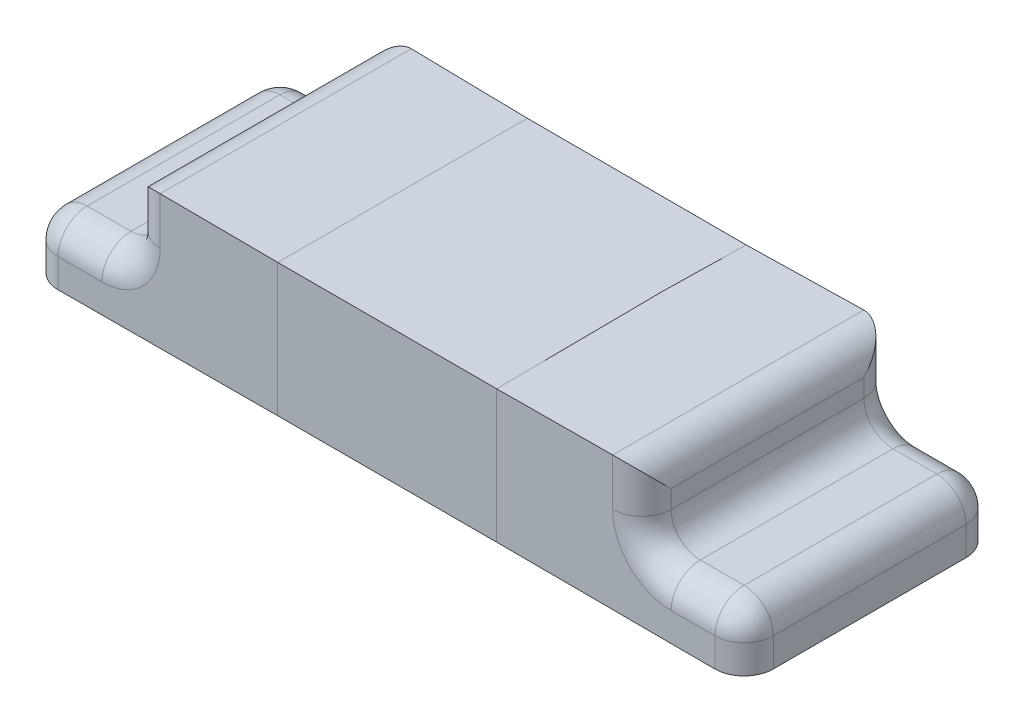
ISO-10303-21;
HEADER;
FILE_DESCRIPTION(('STEP AP214'),'2;1');
FILE_NAME('part.step','',(''),(''),'','','');
FILE_SCHEMA(('AUTOMOTIVE_DESIGN { 1 0 10303 214 1 1 1 1 }'));
ENDSEC;
DATA;
#1=APPLICATION_CONTEXT('core data for automotive mechanical design processes');
#2=APPLICATION_PROTOCOL_DEFINITION('international standard','automotive_design',2000,#1);
#3=PRODUCT_CONTEXT('',#1,'mechanical');
#4=PRODUCT('Part','Part','',(#3));
#5=PRODUCT_RELATED_PRODUCT_CATEGORY('part','',(#4));
#6=PRODUCT_DEFINITION_FORMATION('','',#4);
#7=PRODUCT_DEFINITION_CONTEXT('part definition',#1,'design');
#8=PRODUCT_DEFINITION('design','',#6,#7);
#9=PRODUCT_DEFINITION_SHAPE('','',#8);
#10=(LENGTH_UNIT() NAMED_UNIT(*) SI_UNIT(.MILLI.,.METRE.));
#11=(NAMED_UNIT(*) PLANE_ANGLE_UNIT() SI_UNIT($,.RADIAN.));
#12=(NAMED_UNIT(*) SI_UNIT($,.STERADIAN.) SOLID_ANGLE_UNIT());
#13=UNCERTAINTY_MEASURE_WITH_UNIT(LENGTH_MEASURE(1.E-05),#10,'distance_accuracy_value','');
#14=(GEOMETRIC_REPRESENTATION_CONTEXT(3) GLOBAL_UNCERTAINTY_ASSIGNED_CONTEXT((#13)) GLOBAL_UNIT_ASSIGNED_CONTEXT((#10,
#11,#12)) REPRESENTATION_CONTEXT('',''));
#15=CARTESIAN_POINT('',(0.,0.,0.));
#16=DIRECTION('',(0.,0.,1.));
#17=DIRECTION('',(1.,0.,0.));
#18=AXIS2_PLACEMENT_3D('',#15,#16,#17);
#19=CARTESIAN_POINT('',(0.875,0.,0.));
#20=DIRECTION('',(-1.,0.,0.));
#21=DIRECTION('',(0.,0.,1.));
#22=AXIS2_PLACEMENT_3D('',#19,#20,#21);
#23=PLANE('',#22);
#24=DIRECTION('',(0.,1.,0.));
#25=VECTOR('',#24,1.);
#26=CARTESIAN_POINT('',(0.875,0.,-0.33));
#27=LINE('',#26,#25);
#28=CARTESIAN_POINT('',(0.875,0.298442990090282,-0.33));
#29=VERTEX_POINT('',#28);
#30=CARTESIAN_POINT('',(0.875,0.36,-0.33));
#31=VERTEX_POINT('',#30);
#32=EDGE_CURVE('E508',#29,#31,#27,.T.);
#33=ORIENTED_EDGE('',*,*,#32,.T.);
#34=DIRECTION('',(0.,0.,1.));
#35=VECTOR('',#34,1.);
#36=CARTESIAN_POINT('',(0.875,0.36,0.));
#37=LINE('',#36,#35);
#38=CARTESIAN_POINT('',(0.875,0.36,0.33));
#39=VERTEX_POINT('',#38);
#40=EDGE_CURVE('E483',#31,#39,#37,.T.);
#41=ORIENTED_EDGE('',*,*,#40,.T.);
#42=DIRECTION('',(0.,-1.,0.));
#43=VECTOR('',#42,1.);
#44=CARTESIAN_POINT('',(0.875,0.,0.33));
#45=LINE('',#44,#43);
#46=CARTESIAN_POINT('',(0.875,0.298442990090282,0.33));
#47=VERTEX_POINT('',#46);
#48=EDGE_CURVE('E511',#39,#47,#45,.T.);
#49=ORIENTED_EDGE('',*,*,#48,.T.);
#50=DIRECTION('',(0.,0.,1.));
#51=VECTOR('',#50,1.);
#52=CARTESIAN_POINT('',(0.875,0.298442990090282,-0.43));
#53=LINE('',#52,#51);
#54=EDGE_CURVE('E273',#47,#29,#53,.F.);
#55=ORIENTED_EDGE('',*,*,#54,.T.);
#56=EDGE_LOOP('',(#33,#41,#49,#55));
#57=FACE_BOUND('',#56,.T.);
#58=ADVANCED_FACE('F40',(#57),#23,.F.);
#59=CARTESIAN_POINT('',(0.375,0.,-0.425));
#60=DIRECTION('',(0.,0.,1.));
#61=DIRECTION('',(1.,0.,0.));
#62=AXIS2_PLACEMENT_3D('',#59,#60,#61);
#63=PLANE('',#62);
#64=CARTESIAN_POINT('',(-0.375,0.,-0.425));
#65=DIRECTION('',(0.,1.,0.));
#66=VECTOR('',#65,1.);
#67=LINE('',#64,#66);
#68=CARTESIAN_POINT('',(-0.375,0.,-0.4275));
#69=VERTEX_POINT('',#68);
#70=CARTESIAN_POINT('',(-0.375,0.455,-0.4275));
#71=VERTEX_POINT('',#70);
#72=EDGE_CURVE('E233',#69,#71,#67,.T.);
#73=ORIENTED_EDGE('',*,*,#72,.T.);
#74=DIRECTION('',(-1.,0.,0.));
#75=VECTOR('',#74,1.);
#76=CARTESIAN_POINT('',(0.375,0.45,-0.425));
#77=LINE('',#76,#75);
#78=CARTESIAN_POINT('',(0.375,0.454472135955,-0.4272360679775));
#79=VERTEX_POINT('',#78);
#80=EDGE_CURVE('E270',#79,#71,#77,.T.);
#81=ORIENTED_EDGE('',*,*,#80,.F.);
#82=CARTESIAN_POINT('',(0.375,0.,-0.43));
#83=DIRECTION('',(0.,1.,0.));
#84=VECTOR('',#83,1.);
#85=LINE('',#82,#84);
#86=CARTESIAN_POINT('',(0.375,0.,-0.4275));
#87=VERTEX_POINT('',#86);
#88=EDGE_CURVE('E249',#87,#79,#85,.T.);
#89=ORIENTED_EDGE('',*,*,#88,.F.);
#90=DIRECTION('',(-1.,0.,0.));
#91=VECTOR('',#90,1.);
#92=CARTESIAN_POINT('',(0.375,0.,-0.425));
#93=LINE('',#92,#91);
#94=EDGE_CURVE('E222',#87,#69,#93,.T.);
#95=ORIENTED_EDGE('',*,*,#94,.T.);
#96=EDGE_LOOP('',(#73,#81,#89,#95));
#97=FACE_BOUND('',#96,.T.);
#98=ADVANCED_FACE('F247',(#97),#63,.F.);
#99=CARTESIAN_POINT('',(0.375,0.45,0.425));
#100=DIRECTION('',(0.,-1.,0.));
#101=DIRECTION('',(0.,0.,-1.));
#102=AXIS2_PLACEMENT_3D('',#99,#100,#101);
#103=PLANE('',#102);
#104=CARTESIAN_POINT('',(-0.375,0.45,-0.425));
#105=DIRECTION('',(0.,0.,1.));
#106=VECTOR('',#105,1.);
#107=LINE('',#104,#106);
#108=CARTESIAN_POINT('',(-0.375,0.455,0.4275));
#109=VERTEX_POINT('',#108);
#110=EDGE_CURVE('E243',#71,#109,#107,.T.);
#111=ORIENTED_EDGE('',*,*,#110,.T.);
#112=DIRECTION('',(-1.,0.,0.));
#113=VECTOR('',#112,1.);
#114=CARTESIAN_POINT('',(0.375,0.45,0.425));
#115=LINE('',#114,#113);
#116=CARTESIAN_POINT('',(0.375,0.455,0.4275));
#117=VERTEX_POINT('',#116);
#118=EDGE_CURVE('E255',#117,#109,#115,.T.);
#119=ORIENTED_EDGE('',*,*,#118,.F.);
#120=DIRECTION('',(0.,0.,1.));
#121=VECTOR('',#120,1.);
#122=CARTESIAN_POINT('',(0.375,0.45,0.425));
#123=LINE('',#122,#121);
#124=EDGE_CURVE('E258',#79,#117,#123,.T.);
#125=ORIENTED_EDGE('',*,*,#124,.F.);
#126=ORIENTED_EDGE('',*,*,#80,.T.);
#127=EDGE_LOOP('',(#111,#119,#125,#126));
#128=FACE_BOUND('',#127,.T.);
#129=ADVANCED_FACE('F297',(#128),#103,.F.);
#130=CARTESIAN_POINT('',(0.375,0.,0.425));
#131=DIRECTION('',(0.,0.,-1.));
#132=DIRECTION('',(-1.,0.,0.));
#133=AXIS2_PLACEMENT_3D('',#130,#131,#132);
#134=PLANE('',#133);
#135=CARTESIAN_POINT('',(-0.375,0.45,0.425));
#136=DIRECTION('',(0.,-1.,0.));
#137=VECTOR('',#136,1.);
#138=LINE('',#135,#137);
#139=CARTESIAN_POINT('',(-0.375,0.,0.4275));
#140=VERTEX_POINT('',#139);
#141=EDGE_CURVE('E338',#109,#140,#138,.T.);
#142=ORIENTED_EDGE('',*,*,#141,.T.);
#143=DIRECTION('',(-1.,0.,0.));
#144=VECTOR('',#143,1.);
#145=CARTESIAN_POINT('',(0.375,0.,0.425));
#146=LINE('',#145,#144);
#147=CARTESIAN_POINT('',(0.375,0.,0.4275));
#148=VERTEX_POINT('',#147);
#149=EDGE_CURVE('E251',#148,#140,#146,.T.);
#150=ORIENTED_EDGE('',*,*,#149,.F.);
#151=CARTESIAN_POINT('',(0.375,0.46,0.43));
#152=DIRECTION('',(0.,-1.,0.));
#153=VECTOR('',#152,1.);
#154=LINE('',#151,#153);
#155=EDGE_CURVE('E252',#117,#148,#154,.T.);
#156=ORIENTED_EDGE('',*,*,#155,.F.);
#157=ORIENTED_EDGE('',*,*,#118,.T.);
#158=EDGE_LOOP('',(#142,#150,#156,#157));
#159=FACE_BOUND('',#158,.T.);
#160=ADVANCED_FACE('F287',(#159),#134,.F.);
#161=CARTESIAN_POINT('',(0.375,0.,0.425));
#162=DIRECTION('',(0.,1.,0.));
#163=DIRECTION('',(0.,0.,1.));
#164=AXIS2_PLACEMENT_3D('',#161,#162,#163);
#165=PLANE('',#164);
#166=DIRECTION('',(0.,0.,-1.));
#167=VECTOR('',#166,1.);
#168=CARTESIAN_POINT('',(-1.225,0.,0.43));
#169=LINE('',#168,#167);
#170=CARTESIAN_POINT('',(-1.225,0.,0.33));
#171=VERTEX_POINT('',#170);
#172=CARTESIAN_POINT('',(-1.225,0.,-0.33));
#173=VERTEX_POINT('',#172);
#174=EDGE_CURVE('E327',#171,#173,#169,.T.);
#175=ORIENTED_EDGE('',*,*,#174,.T.);
#176=CARTESIAN_POINT('',(-1.125,0.,-0.33));
#177=DIRECTION('',(0.,1.,0.));
#178=DIRECTION('',(0.,0.,1.));
#179=AXIS2_PLACEMENT_3D('',#176,#177,#178);
#180=CIRCLE('',#179,0.1);
#181=CARTESIAN_POINT('',(-1.125,0.,-0.43));
#182=VERTEX_POINT('',#181);
#183=EDGE_CURVE('E225',#173,#182,#180,.F.);
#184=ORIENTED_EDGE('',*,*,#183,.T.);
#185=DIRECTION('',(1.,0.,0.));
#186=VECTOR('',#185,1.);
#187=CARTESIAN_POINT('',(-0.875,0.,-0.43));
#188=LINE('',#187,#186);
#189=EDGE_CURVE('E216',#182,#69,#188,.T.);
#190=ORIENTED_EDGE('',*,*,#189,.T.);
#191=ORIENTED_EDGE('',*,*,#94,.F.);
#192=DIRECTION('',(-1.,0.,0.));
#193=VECTOR('',#192,1.);
#194=CARTESIAN_POINT('',(0.875,0.,-0.43));
#195=LINE('',#194,#193);
#196=CARTESIAN_POINT('',(1.125,0.,-0.43));
#197=VERTEX_POINT('',#196);
#198=EDGE_CURVE('E465',#197,#87,#195,.T.);
#199=ORIENTED_EDGE('',*,*,#198,.F.);
#200=CARTESIAN_POINT('',(1.125,0.,-0.33));
#201=DIRECTION('',(0.,1.,0.));
#202=DIRECTION('',(0.,0.,1.));
#203=AXIS2_PLACEMENT_3D('',#200,#201,#202);
#204=CIRCLE('',#203,0.1);
#205=CARTESIAN_POINT('',(1.225,0.,-0.33));
#206=VERTEX_POINT('',#205);
#207=EDGE_CURVE('E663',#197,#206,#204,.F.);
#208=ORIENTED_EDGE('',*,*,#207,.T.);
#209=DIRECTION('',(0.,0.,-1.));
#210=VECTOR('',#209,1.);
#211=CARTESIAN_POINT('',(1.225,0.,0.43));
#212=LINE('',#211,#210);
#213=CARTESIAN_POINT('',(1.225,0.,0.33));
#214=VERTEX_POINT('',#213);
#215=EDGE_CURVE('E458',#214,#206,#212,.T.);
#216=ORIENTED_EDGE('',*,*,#215,.F.);
#217=CARTESIAN_POINT('',(1.125,0.,0.33));
#218=DIRECTION('',(0.,1.,0.));
#219=DIRECTION('',(0.,0.,1.));
#220=AXIS2_PLACEMENT_3D('',#217,#218,#219);
#221=CIRCLE('',#220,0.1);
#222=CARTESIAN_POINT('',(1.125,0.,0.43));
#223=VERTEX_POINT('',#222);
#224=EDGE_CURVE('E659',#214,#223,#221,.F.);
#225=ORIENTED_EDGE('',*,*,#224,.T.);
#226=DIRECTION('',(-1.,0.,0.));
#227=VECTOR('',#226,1.);
#228=CARTESIAN_POINT('',(0.875,0.,0.43));
#229=LINE('',#228,#227);
#230=EDGE_CURVE('E409',#223,#148,#229,.T.);
#231=ORIENTED_EDGE('',*,*,#230,.T.);
#232=ORIENTED_EDGE('',*,*,#149,.T.);
#233=DIRECTION('',(1.,0.,0.));
#234=VECTOR('',#233,1.);
#235=CARTESIAN_POINT('',(-0.875,0.,0.43));
#236=LINE('',#235,#234);
#237=CARTESIAN_POINT('',(-1.125,0.,0.43));
#238=VERTEX_POINT('',#237);
#239=EDGE_CURVE('E230',#238,#140,#236,.T.);
#240=ORIENTED_EDGE('',*,*,#239,.F.);
#241=CARTESIAN_POINT('',(-1.125,0.,0.33));
#242=DIRECTION('',(0.,1.,0.));
#243=DIRECTION('',(0.,0.,1.));
#244=AXIS2_PLACEMENT_3D('',#241,#242,#243);
#245=CIRCLE('',#244,0.1);
#246=EDGE_CURVE('E63',#238,#171,#245,.F.);
#247=ORIENTED_EDGE('',*,*,#246,.T.);
#248=EDGE_LOOP('',(#175,#184,#190,#191,#199,#208,#216,#225,#231,#232,#240,#247));
#249=FACE_BOUND('',#248,.T.);
#250=ADVANCED_FACE('F219',(#249),#165,.F.);
#251=CARTESIAN_POINT('',(0.875,0.,-0.43));
#252=DIRECTION('',(0.,0.,1.));
#253=DIRECTION('',(1.,0.,0.));
#254=AXIS2_PLACEMENT_3D('',#251,#252,#253);
#255=PLANE('',#254);
#256=DIRECTION('',(-1.,0.,0.));
#257=VECTOR('',#256,1.);
#258=CARTESIAN_POINT('',(0.875,0.098442990090282,-0.43));
#259=LINE('',#258,#257);
#260=CARTESIAN_POINT('',(0.975,0.098442990090282,-0.43));
#261=VERTEX_POINT('',#260);
#262=CARTESIAN_POINT('',(1.125,0.098442990090282,-0.43));
#263=VERTEX_POINT('',#262);
#264=EDGE_CURVE('E485',#261,#263,#259,.F.);
#265=ORIENTED_EDGE('',*,*,#264,.T.);
#266=DIRECTION('',(0.,1.,0.));
#267=VECTOR('',#266,1.);
#268=CARTESIAN_POINT('',(1.125,0.,-0.43));
#269=LINE('',#268,#267);
#270=EDGE_CURVE('E464',#263,#197,#269,.F.);
#271=ORIENTED_EDGE('',*,*,#270,.T.);
#272=ORIENTED_EDGE('',*,*,#198,.T.);
#273=ORIENTED_EDGE('',*,*,#88,.T.);
#274=DIRECTION('',(-1.,0.,0.));
#275=VECTOR('',#274,1.);
#276=CARTESIAN_POINT('',(0.875,0.46,-0.43));
#277=LINE('',#276,#275);
#278=CARTESIAN_POINT('',(0.775,0.46,-0.43));
#279=VERTEX_POINT('',#278);
#280=EDGE_CURVE('E244',#279,#79,#277,.T.);
#281=ORIENTED_EDGE('',*,*,#280,.F.);
#282=DIRECTION('',(0.,1.,0.));
#283=VECTOR('',#282,1.);
#284=CARTESIAN_POINT('',(0.775,0.,-0.43));
#285=LINE('',#284,#283);
#286=CARTESIAN_POINT('',(0.775,0.298442990090282,-0.43));
#287=VERTEX_POINT('',#286);
#288=EDGE_CURVE('E410',#279,#287,#285,.F.);
#289=ORIENTED_EDGE('',*,*,#288,.T.);
#290=CARTESIAN_POINT('',(0.975,0.298442990090282,-0.43));
#291=DIRECTION('',(0.,0.,1.));
#292=DIRECTION('',(1.,0.,0.));
#293=AXIS2_PLACEMENT_3D('',#290,#291,#292);
#294=CIRCLE('',#293,0.2);
#295=EDGE_CURVE('E487',#261,#287,#294,.F.);
#296=ORIENTED_EDGE('',*,*,#295,.F.);
#297=EDGE_LOOP('',(#265,#271,#272,#273,#281,#289,#296));
#298=FACE_BOUND('',#297,.T.);
#299=ADVANCED_FACE('F495',(#298),#255,.F.);
#300=CARTESIAN_POINT('',(0.875,0.46,0.43));
#301=DIRECTION('',(0.,-1.,0.));
#302=DIRECTION('',(0.,0.,-1.));
#303=AXIS2_PLACEMENT_3D('',#300,#301,#302);
#304=PLANE('',#303);
#305=DIRECTION('',(-1.,0.,0.));
#306=VECTOR('',#305,1.);
#307=CARTESIAN_POINT('',(0.875,0.46,0.43));
#308=LINE('',#307,#306);
#309=CARTESIAN_POINT('',(0.775,0.46,0.43));
#310=VERTEX_POINT('',#309);
#311=EDGE_CURVE('E406',#310,#117,#308,.T.);
#312=ORIENTED_EDGE('',*,*,#311,.F.);
#313=DIRECTION('',(0.,0.,1.));
#314=VECTOR('',#313,1.);
#315=CARTESIAN_POINT('',(0.775,0.46,0.43));
#316=LINE('',#315,#314);
#317=EDGE_CURVE('E419',#310,#279,#316,.F.);
#318=ORIENTED_EDGE('',*,*,#317,.T.);
#319=ORIENTED_EDGE('',*,*,#280,.T.);
#320=DIRECTION('',(0.,0.,1.));
#321=VECTOR('',#320,1.);
#322=CARTESIAN_POINT('',(0.375,0.46,0.43));
#323=LINE('',#322,#321);
#324=EDGE_CURVE('E468',#79,#117,#323,.T.);
#325=ORIENTED_EDGE('',*,*,#324,.T.);
#326=EDGE_LOOP('',(#312,#318,#319,#325));
#327=FACE_BOUND('',#326,.T.);
#328=ADVANCED_FACE('F389',(#327),#304,.F.);
#329=CARTESIAN_POINT('',(0.875,0.,0.43));
#330=DIRECTION('',(0.,0.,-1.));
#331=DIRECTION('',(-1.,0.,0.));
#332=AXIS2_PLACEMENT_3D('',#329,#330,#331);
#333=PLANE('',#332);
#334=ORIENTED_EDGE('',*,*,#230,.F.);
#335=DIRECTION('',(0.,-1.,0.));
#336=VECTOR('',#335,1.);
#337=CARTESIAN_POINT('',(1.125,0.,0.43));
#338=LINE('',#337,#336);
#339=CARTESIAN_POINT('',(1.125,0.098442990090282,0.43));
#340=VERTEX_POINT('',#339);
#341=EDGE_CURVE('E665',#223,#340,#338,.F.);
#342=ORIENTED_EDGE('',*,*,#341,.T.);
#343=DIRECTION('',(-1.,0.,0.));
#344=VECTOR('',#343,1.);
#345=CARTESIAN_POINT('',(0.875,0.098442990090282,0.43));
#346=LINE('',#345,#344);
#347=CARTESIAN_POINT('',(0.975,0.098442990090282,0.43));
#348=VERTEX_POINT('',#347);
#349=EDGE_CURVE('E415',#340,#348,#346,.T.);
#350=ORIENTED_EDGE('',*,*,#349,.T.);
#351=CARTESIAN_POINT('',(0.975,0.298442990090282,0.43));
#352=DIRECTION('',(0.,0.,-1.));
#353=DIRECTION('',(-1.,0.,0.));
#354=AXIS2_PLACEMENT_3D('',#351,#352,#353);
#355=CIRCLE('',#354,0.2);
#356=CARTESIAN_POINT('',(0.775,0.298442990090282,0.43));
#357=VERTEX_POINT('',#356);
#358=EDGE_CURVE('E412',#357,#348,#355,.F.);
#359=ORIENTED_EDGE('',*,*,#358,.F.);
#360=DIRECTION('',(0.,-1.,0.));
#361=VECTOR('',#360,1.);
#362=CARTESIAN_POINT('',(0.775,0.,0.43));
#363=LINE('',#362,#361);
#364=EDGE_CURVE('E417',#357,#310,#363,.F.);
#365=ORIENTED_EDGE('',*,*,#364,.T.);
#366=ORIENTED_EDGE('',*,*,#311,.T.);
#367=ORIENTED_EDGE('',*,*,#155,.T.);
#368=EDGE_LOOP('',(#334,#342,#350,#359,#365,#366,#367));
#369=FACE_BOUND('',#368,.T.);
#370=ADVANCED_FACE('F384',(#369),#333,.F.);
#371=CARTESIAN_POINT('',(0.375,0.,0.));
#372=DIRECTION('',(-1.,0.,0.));
#373=DIRECTION('',(0.,0.,1.));
#374=AXIS2_PLACEMENT_3D('',#371,#372,#373);
#375=PLANE('',#374);
#376=ORIENTED_EDGE('',*,*,#324,.F.);
#377=ORIENTED_EDGE('',*,*,#124,.T.);
#378=EDGE_LOOP('',(#376,#377));
#379=FACE_BOUND('',#378,.T.);
#380=ADVANCED_FACE('F377',(#379),#375,.T.);
#381=CARTESIAN_POINT('',(1.225,0.198442990090282,0.43));
#382=DIRECTION('',(0.,-1.,0.));
#383=DIRECTION('',(0.,0.,-1.));
#384=AXIS2_PLACEMENT_3D('',#381,#382,#383);
#385=PLANE('',#384);
#386=DIRECTION('',(-1.,0.,0.));
#387=VECTOR('',#386,1.);
#388=CARTESIAN_POINT('',(1.225,0.198442990090282,-0.33));
#389=LINE('',#388,#387);
#390=CARTESIAN_POINT('',(1.125,0.198442990090282,-0.33));
#391=VERTEX_POINT('',#390);
#392=CARTESIAN_POINT('',(0.975,0.198442990090282,-0.33));
#393=VERTEX_POINT('',#392);
#394=EDGE_CURVE('E427',#391,#393,#389,.T.);
#395=ORIENTED_EDGE('',*,*,#394,.T.);
#396=DIRECTION('',(0.,0.,1.));
#397=VECTOR('',#396,1.);
#398=CARTESIAN_POINT('',(0.975,0.198442990090282,0.43));
#399=LINE('',#398,#397);
#400=CARTESIAN_POINT('',(0.975,0.198442990090282,0.33));
#401=VERTEX_POINT('',#400);
#402=EDGE_CURVE('E430',#393,#401,#399,.T.);
#403=ORIENTED_EDGE('',*,*,#402,.T.);
#404=DIRECTION('',(-1.,0.,0.));
#405=VECTOR('',#404,1.);
#406=CARTESIAN_POINT('',(1.225,0.198442990090282,0.33));
#407=LINE('',#406,#405);
#408=CARTESIAN_POINT('',(1.125,0.198442990090282,0.33));
#409=VERTEX_POINT('',#408);
#410=EDGE_CURVE('E424',#401,#409,#407,.F.);
#411=ORIENTED_EDGE('',*,*,#410,.T.);
#412=DIRECTION('',(0.,0.,1.));
#413=VECTOR('',#412,1.);
#414=CARTESIAN_POINT('',(1.125,0.198442990090282,0.43));
#415=LINE('',#414,#413);
#416=EDGE_CURVE('E421',#409,#391,#415,.F.);
#417=ORIENTED_EDGE('',*,*,#416,.T.);
#418=EDGE_LOOP('',(#395,#403,#411,#417));
#419=FACE_BOUND('',#418,.T.);
#420=ADVANCED_FACE('F373',(#419),#385,.F.);
#421=CARTESIAN_POINT('',(1.225,0.,0.));
#422=DIRECTION('',(-1.,0.,0.));
#423=DIRECTION('',(0.,0.,1.));
#424=AXIS2_PLACEMENT_3D('',#421,#422,#423);
#425=PLANE('',#424);
#426=ORIENTED_EDGE('',*,*,#215,.T.);
#427=DIRECTION('',(0.,1.,0.));
#428=VECTOR('',#427,1.);
#429=CARTESIAN_POINT('',(1.225,0.,-0.33));
#430=LINE('',#429,#428);
#431=CARTESIAN_POINT('',(1.225,0.098442990090282,-0.33));
#432=VERTEX_POINT('',#431);
#433=EDGE_CURVE('E461',#206,#432,#430,.T.);
#434=ORIENTED_EDGE('',*,*,#433,.T.);
#435=DIRECTION('',(0.,0.,1.));
#436=VECTOR('',#435,1.);
#437=CARTESIAN_POINT('',(1.225,0.098442990090282,0.));
#438=LINE('',#437,#436);
#439=CARTESIAN_POINT('',(1.225,0.098442990090282,0.33));
#440=VERTEX_POINT('',#439);
#441=EDGE_CURVE('E432',#432,#440,#438,.T.);
#442=ORIENTED_EDGE('',*,*,#441,.T.);
#443=DIRECTION('',(0.,-1.,0.));
#444=VECTOR('',#443,1.);
#445=CARTESIAN_POINT('',(1.225,0.,0.33));
#446=LINE('',#445,#444);
#447=EDGE_CURVE('E435',#440,#214,#446,.T.);
#448=ORIENTED_EDGE('',*,*,#447,.T.);
#449=EDGE_LOOP('',(#426,#434,#442,#448));
#450=FACE_BOUND('',#449,.T.);
#451=ADVANCED_FACE('F362',(#450),#425,.F.);
#452=CARTESIAN_POINT('',(0.875,0.098442990090282,0.33));
#453=DIRECTION('',(-1.,0.,0.));
#454=DIRECTION('',(0.,0.,1.));
#455=AXIS2_PLACEMENT_3D('',#452,#453,#454);
#456=CYLINDRICAL_SURFACE('',#455,0.1);
#457=ORIENTED_EDGE('',*,*,#349,.F.);
#458=CARTESIAN_POINT('',(1.125,0.098442990090282,0.33));
#459=DIRECTION('',(-1.,0.,0.));
#460=DIRECTION('',(0.,0.,1.));
#461=AXIS2_PLACEMENT_3D('',#458,#459,#460);
#462=CIRCLE('',#461,0.1);
#463=EDGE_CURVE('E673',#340,#409,#462,.T.);
#464=ORIENTED_EDGE('',*,*,#463,.T.);
#465=ORIENTED_EDGE('',*,*,#410,.F.);
#466=CARTESIAN_POINT('',(0.975,0.098442990090282,0.33));
#467=DIRECTION('',(-1.,0.,0.));
#468=DIRECTION('',(0.,0.,1.));
#469=AXIS2_PLACEMENT_3D('',#466,#467,#468);
#470=CIRCLE('',#469,0.1);
#471=EDGE_CURVE('E455',#348,#401,#470,.T.);
#472=ORIENTED_EDGE('',*,*,#471,.F.);
#473=EDGE_LOOP('',(#457,#464,#465,#472));
#474=FACE_BOUND('',#473,.T.);
#475=ADVANCED_FACE('F372',(#474),#456,.T.);
#476=CARTESIAN_POINT('',(1.125,0.098442990090282,0.));
#477=DIRECTION('',(0.,0.,1.));
#478=DIRECTION('',(1.,0.,0.));
#479=AXIS2_PLACEMENT_3D('',#476,#477,#478);
#480=CYLINDRICAL_SURFACE('',#479,0.1);
#481=ORIENTED_EDGE('',*,*,#441,.F.);
#482=CARTESIAN_POINT('',(1.125,0.098442990090282,-0.33));
#483=DIRECTION('',(0.,0.,1.));
#484=DIRECTION('',(1.,0.,0.));
#485=AXIS2_PLACEMENT_3D('',#482,#483,#484);
#486=CIRCLE('',#485,0.1);
#487=EDGE_CURVE('E671',#432,#391,#486,.T.);
#488=ORIENTED_EDGE('',*,*,#487,.T.);
#489=ORIENTED_EDGE('',*,*,#416,.F.);
#490=CARTESIAN_POINT('',(1.125,0.098442990090282,0.33));
#491=DIRECTION('',(0.,0.,1.));
#492=DIRECTION('',(1.,0.,0.));
#493=AXIS2_PLACEMENT_3D('',#490,#491,#492);
#494=CIRCLE('',#493,0.1);
#495=EDGE_CURVE('E669',#409,#440,#494,.F.);
#496=ORIENTED_EDGE('',*,*,#495,.T.);
#497=EDGE_LOOP('',(#481,#488,#489,#496));
#498=FACE_BOUND('',#497,.T.);
#499=ADVANCED_FACE('F548',(#498),#480,.T.);
#500=CARTESIAN_POINT('',(0.975,0.298442990090282,0.33));
#501=DIRECTION('',(0.,0.,-1.));
#502=DIRECTION('',(-1.,0.,0.));
#503=AXIS2_PLACEMENT_3D('',#500,#501,#502);
#504=TOROIDAL_SURFACE('',#503,0.2,0.1);
#505=ORIENTED_EDGE('',*,*,#358,.T.);
#506=ORIENTED_EDGE('',*,*,#471,.T.);
#507=CARTESIAN_POINT('',(0.975,0.298442990090282,0.33));
#508=DIRECTION('',(0.,0.,-1.));
#509=DIRECTION('',(-1.,0.,0.));
#510=AXIS2_PLACEMENT_3D('',#507,#508,#509);
#511=CIRCLE('',#510,0.1);
#512=EDGE_CURVE('E452',#47,#401,#511,.F.);
#513=ORIENTED_EDGE('',*,*,#512,.F.);
#514=CARTESIAN_POINT('',(0.775,0.298442990090282,0.33));
#515=DIRECTION('',(0.,-1.,0.));
#516=DIRECTION('',(0.,0.,-1.));
#517=AXIS2_PLACEMENT_3D('',#514,#515,#516);
#518=CIRCLE('',#517,0.1);
#519=EDGE_CURVE('E449',#357,#47,#518,.F.);
#520=ORIENTED_EDGE('',*,*,#519,.F.);
#521=EDGE_LOOP('',(#505,#506,#513,#520));
#522=FACE_BOUND('',#521,.T.);
#523=ADVANCED_FACE('F523',(#522),#504,.T.);
#524=CARTESIAN_POINT('',(1.225,0.098442990090282,-0.33));
#525=DIRECTION('',(-1.,0.,0.));
#526=DIRECTION('',(0.,0.,1.));
#527=AXIS2_PLACEMENT_3D('',#524,#525,#526);
#528=CYLINDRICAL_SURFACE('',#527,0.1);
#529=ORIENTED_EDGE('',*,*,#394,.F.);
#530=CARTESIAN_POINT('',(1.125,0.098442990090282,-0.33));
#531=DIRECTION('',(-1.,0.,0.));
#532=DIRECTION('',(0.,0.,1.));
#533=AXIS2_PLACEMENT_3D('',#530,#531,#532);
#534=CIRCLE('',#533,0.1);
#535=EDGE_CURVE('E667',#391,#263,#534,.T.);
#536=ORIENTED_EDGE('',*,*,#535,.T.);
#537=ORIENTED_EDGE('',*,*,#264,.F.);
#538=CARTESIAN_POINT('',(0.975,0.098442990090282,-0.33));
#539=DIRECTION('',(-1.,0.,0.));
#540=DIRECTION('',(0.,0.,1.));
#541=AXIS2_PLACEMENT_3D('',#538,#539,#540);
#542=CIRCLE('',#541,0.1);
#543=EDGE_CURVE('E446',#393,#261,#542,.T.);
#544=ORIENTED_EDGE('',*,*,#543,.F.);
#545=EDGE_LOOP('',(#529,#536,#537,#544));
#546=FACE_BOUND('',#545,.T.);
#547=ADVANCED_FACE('F542',(#546),#528,.T.);
#548=CARTESIAN_POINT('',(0.975,0.298442990090282,0.43));
#549=DIRECTION('',(0.,0.,-1.));
#550=DIRECTION('',(-1.,0.,0.));
#551=AXIS2_PLACEMENT_3D('',#548,#549,#550);
#552=CYLINDRICAL_SURFACE('',#551,0.1);
#553=ORIENTED_EDGE('',*,*,#512,.T.);
#554=ORIENTED_EDGE('',*,*,#402,.F.);
#555=CARTESIAN_POINT('',(0.975,0.298442990090282,-0.33));
#556=DIRECTION('',(0.,0.,1.));
#557=DIRECTION('',(1.,0.,0.));
#558=AXIS2_PLACEMENT_3D('',#555,#556,#557);
#559=CIRCLE('',#558,0.1);
#560=EDGE_CURVE('E444',#29,#393,#559,.T.);
#561=ORIENTED_EDGE('',*,*,#560,.F.);
#562=ORIENTED_EDGE('',*,*,#54,.F.);
#563=EDGE_LOOP('',(#553,#554,#561,#562));
#564=FACE_BOUND('',#563,.T.);
#565=ADVANCED_FACE('F527',(#564),#552,.F.);
#566=CARTESIAN_POINT('',(0.775,0.,0.33));
#567=DIRECTION('',(0.,-1.,0.));
#568=DIRECTION('',(0.,0.,-1.));
#569=AXIS2_PLACEMENT_3D('',#566,#567,#568);
#570=CYLINDRICAL_SURFACE('',#569,0.1);
#571=ORIENTED_EDGE('',*,*,#519,.T.);
#572=ORIENTED_EDGE('',*,*,#48,.F.);
#573=CARTESIAN_POINT('',(0.775,0.36,0.33));
#574=DIRECTION('',(0.,-0.707106781186547,0.707106781186547));
#575=DIRECTION('',(0.,0.707106781186547,0.707106781186547));
#576=AXIS2_PLACEMENT_3D('',#573,#574,#575);
#577=ELLIPSE('',#576,0.14142135623731,0.1);
#578=EDGE_CURVE('E441',#310,#39,#577,.F.);
#579=ORIENTED_EDGE('',*,*,#578,.F.);
#580=ORIENTED_EDGE('',*,*,#364,.F.);
#581=EDGE_LOOP('',(#571,#572,#579,#580));
#582=FACE_BOUND('',#581,.T.);
#583=ADVANCED_FACE('F521',(#582),#570,.T.);
#584=CARTESIAN_POINT('',(0.975,0.298442990090282,-0.33));
#585=DIRECTION('',(0.,0.,1.));
#586=DIRECTION('',(1.,0.,0.));
#587=AXIS2_PLACEMENT_3D('',#584,#585,#586);
#588=TOROIDAL_SURFACE('',#587,0.2,0.1);
#589=ORIENTED_EDGE('',*,*,#543,.T.);
#590=ORIENTED_EDGE('',*,*,#295,.T.);
#591=CARTESIAN_POINT('',(0.775,0.298442990090282,-0.33));
#592=DIRECTION('',(0.,-1.,0.));
#593=DIRECTION('',(0.,0.,-1.));
#594=AXIS2_PLACEMENT_3D('',#591,#592,#593);
#595=CIRCLE('',#594,0.1);
#596=EDGE_CURVE('E438',#29,#287,#595,.F.);
#597=ORIENTED_EDGE('',*,*,#596,.F.);
#598=ORIENTED_EDGE('',*,*,#560,.T.);
#599=EDGE_LOOP('',(#589,#590,#597,#598));
#600=FACE_BOUND('',#599,.T.);
#601=ADVANCED_FACE('F529',(#600),#588,.T.);
#602=CARTESIAN_POINT('',(0.775,0.36,0.));
#603=DIRECTION('',(0.,0.,1.));
#604=DIRECTION('',(1.,0.,0.));
#605=AXIS2_PLACEMENT_3D('',#602,#603,#604);
#606=CYLINDRICAL_SURFACE('',#605,0.1);
#607=ORIENTED_EDGE('',*,*,#578,.T.);
#608=ORIENTED_EDGE('',*,*,#40,.F.);
#609=CARTESIAN_POINT('',(0.775,0.36,-0.33));
#610=DIRECTION('',(0.,0.707106781186547,0.707106781186547));
#611=DIRECTION('',(0.,-0.707106781186547,0.707106781186547));
#612=AXIS2_PLACEMENT_3D('',#609,#610,#611);
#613=ELLIPSE('',#612,0.14142135623731,0.1);
#614=EDGE_CURVE('E436',#279,#31,#613,.F.);
#615=ORIENTED_EDGE('',*,*,#614,.F.);
#616=ORIENTED_EDGE('',*,*,#317,.F.);
#617=EDGE_LOOP('',(#607,#608,#615,#616));
#618=FACE_BOUND('',#617,.T.);
#619=ADVANCED_FACE('F504',(#618),#606,.T.);
#620=CARTESIAN_POINT('',(0.775,0.,-0.33));
#621=DIRECTION('',(0.,1.,0.));
#622=DIRECTION('',(0.,0.,1.));
#623=AXIS2_PLACEMENT_3D('',#620,#621,#622);
#624=CYLINDRICAL_SURFACE('',#623,0.1);
#625=ORIENTED_EDGE('',*,*,#596,.T.);
#626=ORIENTED_EDGE('',*,*,#288,.F.);
#627=ORIENTED_EDGE('',*,*,#614,.T.);
#628=ORIENTED_EDGE('',*,*,#32,.F.);
#629=EDGE_LOOP('',(#625,#626,#627,#628));
#630=FACE_BOUND('',#629,.T.);
#631=ADVANCED_FACE('F499',(#630),#624,.T.);
#632=CARTESIAN_POINT('',(1.125,0.098442990090282,-0.33));
#633=DIRECTION('',(0.,0.,1.));
#634=DIRECTION('',(1.,0.,0.));
#635=AXIS2_PLACEMENT_3D('',#632,#633,#634);
#636=SPHERICAL_SURFACE('',#635,0.1);
#637=ORIENTED_EDGE('',*,*,#535,.F.);
#638=ORIENTED_EDGE('',*,*,#487,.F.);
#639=CARTESIAN_POINT('',(1.125,0.098442990090282,-0.33));
#640=DIRECTION('',(0.,-1.,0.));
#641=DIRECTION('',(0.,0.,-1.));
#642=AXIS2_PLACEMENT_3D('',#639,#640,#641);
#643=CIRCLE('',#642,0.1);
#644=EDGE_CURVE('E439',#263,#432,#643,.T.);
#645=ORIENTED_EDGE('',*,*,#644,.F.);
#646=EDGE_LOOP('',(#637,#638,#645));
#647=FACE_BOUND('',#646,.T.);
#648=ADVANCED_FACE('F559',(#647),#636,.T.);
#649=CARTESIAN_POINT('',(1.125,0.,-0.33));
#650=DIRECTION('',(0.,1.,0.));
#651=DIRECTION('',(0.,0.,1.));
#652=AXIS2_PLACEMENT_3D('',#649,#650,#651);
#653=CYLINDRICAL_SURFACE('',#652,0.1);
#654=ORIENTED_EDGE('',*,*,#207,.F.);
#655=ORIENTED_EDGE('',*,*,#270,.F.);
#656=ORIENTED_EDGE('',*,*,#644,.T.);
#657=ORIENTED_EDGE('',*,*,#433,.F.);
#658=EDGE_LOOP('',(#654,#655,#656,#657));
#659=FACE_BOUND('',#658,.T.);
#660=ADVANCED_FACE('F555',(#659),#653,.T.);
#661=CARTESIAN_POINT('',(1.125,0.098442990090282,0.33));
#662=DIRECTION('',(0.,0.,1.));
#663=DIRECTION('',(1.,0.,0.));
#664=AXIS2_PLACEMENT_3D('',#661,#662,#663);
#665=SPHERICAL_SURFACE('',#664,0.1);
#666=ORIENTED_EDGE('',*,*,#495,.F.);
#667=ORIENTED_EDGE('',*,*,#463,.F.);
#668=CARTESIAN_POINT('',(1.125,0.098442990090282,0.33));
#669=DIRECTION('',(0.,-1.,0.));
#670=DIRECTION('',(0.,0.,-1.));
#671=AXIS2_PLACEMENT_3D('',#668,#669,#670);
#672=CIRCLE('',#671,0.1);
#673=EDGE_CURVE('E229',#440,#340,#672,.T.);
#674=ORIENTED_EDGE('',*,*,#673,.F.);
#675=EDGE_LOOP('',(#666,#667,#674));
#676=FACE_BOUND('',#675,.T.);
#677=ADVANCED_FACE('F558',(#676),#665,.T.);
#678=CARTESIAN_POINT('',(1.125,0.,0.33));
#679=DIRECTION('',(0.,-1.,0.));
#680=DIRECTION('',(0.,0.,-1.));
#681=AXIS2_PLACEMENT_3D('',#678,#679,#680);
#682=CYLINDRICAL_SURFACE('',#681,0.1);
#683=ORIENTED_EDGE('',*,*,#673,.T.);
#684=ORIENTED_EDGE('',*,*,#341,.F.);
#685=ORIENTED_EDGE('',*,*,#224,.F.);
#686=ORIENTED_EDGE('',*,*,#447,.F.);
#687=EDGE_LOOP('',(#683,#684,#685,#686));
#688=FACE_BOUND('',#687,.T.);
#689=ADVANCED_FACE('F361',(#688),#682,.T.);
#690=CARTESIAN_POINT('',(-0.875,0.,-0.43));
#691=DIRECTION('',(0.,0.,-1.));
#692=DIRECTION('',(-1.,0.,0.));
#693=AXIS2_PLACEMENT_3D('',#690,#691,#692);
#694=PLANE('',#693);
#695=ORIENTED_EDGE('',*,*,#189,.F.);
#696=DIRECTION('',(0.,1.,0.));
#697=VECTOR('',#696,1.);
#698=CARTESIAN_POINT('',(-1.125,0.098442990090282,-0.43));
#699=LINE('',#698,#697);
#700=CARTESIAN_POINT('',(-1.125,0.098442990090282,-0.43));
#701=VERTEX_POINT('',#700);
#702=EDGE_CURVE('E1065',#182,#701,#699,.T.);
#703=ORIENTED_EDGE('',*,*,#702,.T.);
#704=DIRECTION('',(1.,0.,0.));
#705=VECTOR('',#704,1.);
#706=CARTESIAN_POINT('',(-0.875,0.098442990090282,-0.43));
#707=LINE('',#706,#705);
#708=CARTESIAN_POINT('',(-0.975,0.098442990090282,-0.43));
#709=VERTEX_POINT('',#708);
#710=EDGE_CURVE('E1072',#701,#709,#707,.T.);
#711=ORIENTED_EDGE('',*,*,#710,.T.);
#712=CARTESIAN_POINT('',(-0.975,0.298442990090282,-0.43));
#713=DIRECTION('',(0.,0.,-1.));
#714=DIRECTION('',(-1.,0.,0.));
#715=AXIS2_PLACEMENT_3D('',#712,#713,#714);
#716=CIRCLE('',#715,0.2);
#717=CARTESIAN_POINT('',(-0.775,0.298442990090282,-0.43));
#718=VERTEX_POINT('',#717);
#719=EDGE_CURVE('E328',#718,#709,#716,.T.);
#720=ORIENTED_EDGE('',*,*,#719,.F.);
#721=DIRECTION('',(0.,1.,0.));
#722=VECTOR('',#721,1.);
#723=CARTESIAN_POINT('',(-0.775,0.46,-0.43));
#724=LINE('',#723,#722);
#725=CARTESIAN_POINT('',(-0.775,0.46,-0.43));
#726=VERTEX_POINT('',#725);
#727=EDGE_CURVE('E1078',#718,#726,#724,.T.);
#728=ORIENTED_EDGE('',*,*,#727,.T.);
#729=DIRECTION('',(1.,0.,0.));
#730=VECTOR('',#729,1.);
#731=CARTESIAN_POINT('',(-0.875,0.46,-0.43));
#732=LINE('',#731,#730);
#733=EDGE_CURVE('E238',#726,#71,#732,.T.);
#734=ORIENTED_EDGE('',*,*,#733,.T.);
#735=ORIENTED_EDGE('',*,*,#72,.F.);
#736=EDGE_LOOP('',(#695,#703,#711,#720,#728,#734,#735));
#737=FACE_BOUND('',#736,.T.);
#738=ADVANCED_FACE('F235',(#737),#694,.T.);
#739=CARTESIAN_POINT('',(-0.875,0.,0.43));
#740=DIRECTION('',(0.,0.,1.));
#741=DIRECTION('',(1.,0.,0.));
#742=AXIS2_PLACEMENT_3D('',#739,#740,#741);
#743=PLANE('',#742);
#744=DIRECTION('',(1.,0.,0.));
#745=VECTOR('',#744,1.);
#746=CARTESIAN_POINT('',(-0.875,0.098442990090282,0.43));
#747=LINE('',#746,#745);
#748=CARTESIAN_POINT('',(-0.975,0.098442990090282,0.43));
#749=VERTEX_POINT('',#748);
#750=CARTESIAN_POINT('',(-1.125,0.098442990090282,0.43));
#751=VERTEX_POINT('',#750);
#752=EDGE_CURVE('E1090',#749,#751,#747,.F.);
#753=ORIENTED_EDGE('',*,*,#752,.T.);
#754=DIRECTION('',(0.,-1.,0.));
#755=VECTOR('',#754,1.);
#756=CARTESIAN_POINT('',(-1.125,0.,0.43));
#757=LINE('',#756,#755);
#758=EDGE_CURVE('E622',#751,#238,#757,.T.);
#759=ORIENTED_EDGE('',*,*,#758,.T.);
#760=ORIENTED_EDGE('',*,*,#239,.T.);
#761=ORIENTED_EDGE('',*,*,#141,.F.);
#762=DIRECTION('',(1.,0.,0.));
#763=VECTOR('',#762,1.);
#764=CARTESIAN_POINT('',(-0.875,0.46,0.43));
#765=LINE('',#764,#763);
#766=CARTESIAN_POINT('',(-0.775,0.46,0.43));
#767=VERTEX_POINT('',#766);
#768=EDGE_CURVE('E326',#767,#109,#765,.T.);
#769=ORIENTED_EDGE('',*,*,#768,.F.);
#770=DIRECTION('',(0.,-1.,0.));
#771=VECTOR('',#770,1.);
#772=CARTESIAN_POINT('',(-0.775,0.198442990090282,0.43));
#773=LINE('',#772,#771);
#774=CARTESIAN_POINT('',(-0.775,0.298442990090282,0.43));
#775=VERTEX_POINT('',#774);
#776=EDGE_CURVE('E1096',#767,#775,#773,.T.);
#777=ORIENTED_EDGE('',*,*,#776,.T.);
#778=CARTESIAN_POINT('',(-0.975,0.298442990090282,0.43));
#779=DIRECTION('',(0.,0.,1.));
#780=DIRECTION('',(1.,0.,0.));
#781=AXIS2_PLACEMENT_3D('',#778,#779,#780);
#782=CIRCLE('',#781,0.2);
#783=EDGE_CURVE('E1093',#749,#775,#782,.T.);
#784=ORIENTED_EDGE('',*,*,#783,.F.);
#785=EDGE_LOOP('',(#753,#759,#760,#761,#769,#777,#784));
#786=FACE_BOUND('',#785,.T.);
#787=ADVANCED_FACE('F345',(#786),#743,.T.);
#788=CARTESIAN_POINT('',(-0.875,0.46,0.43));
#789=DIRECTION('',(0.,1.,0.));
#790=DIRECTION('',(0.,0.,1.));
#791=AXIS2_PLACEMENT_3D('',#788,#789,#790);
#792=PLANE('',#791);
#793=ORIENTED_EDGE('',*,*,#733,.F.);
#794=DIRECTION('',(0.,0.,1.));
#795=VECTOR('',#794,1.);
#796=CARTESIAN_POINT('',(-0.775,0.46,0.43));
#797=LINE('',#796,#795);
#798=EDGE_CURVE('E1098',#726,#767,#797,.T.);
#799=ORIENTED_EDGE('',*,*,#798,.T.);
#800=ORIENTED_EDGE('',*,*,#768,.T.);
#801=ORIENTED_EDGE('',*,*,#110,.F.);
#802=EDGE_LOOP('',(#793,#799,#800,#801));
#803=FACE_BOUND('',#802,.T.);
#804=ADVANCED_FACE('F355',(#803),#792,.T.);
#805=CARTESIAN_POINT('',(-0.875,0.,0.));
#806=DIRECTION('',(1.,0.,0.));
#807=DIRECTION('',(0.,0.,1.));
#808=AXIS2_PLACEMENT_3D('',#805,#806,#807);
#809=PLANE('',#808);
#810=DIRECTION('',(0.,-1.,0.));
#811=VECTOR('',#810,1.);
#812=CARTESIAN_POINT('',(-0.875,0.46,0.33));
#813=LINE('',#812,#811);
#814=CARTESIAN_POINT('',(-0.875,0.298442990090282,0.33));
#815=VERTEX_POINT('',#814);
#816=CARTESIAN_POINT('',(-0.875,0.36,0.33));
#817=VERTEX_POINT('',#816);
#818=EDGE_CURVE('E1083',#815,#817,#813,.F.);
#819=ORIENTED_EDGE('',*,*,#818,.T.);
#820=DIRECTION('',(0.,0.,1.));
#821=VECTOR('',#820,1.);
#822=CARTESIAN_POINT('',(-0.875,0.36,-0.43));
#823=LINE('',#822,#821);
#824=CARTESIAN_POINT('',(-0.875,0.36,-0.33));
#825=VERTEX_POINT('',#824);
#826=EDGE_CURVE('E1088',#817,#825,#823,.F.);
#827=ORIENTED_EDGE('',*,*,#826,.T.);
#828=DIRECTION('',(0.,1.,0.));
#829=VECTOR('',#828,1.);
#830=CARTESIAN_POINT('',(-0.875,0.198442990090282,-0.33));
#831=LINE('',#830,#829);
#832=CARTESIAN_POINT('',(-0.875,0.298442990090282,-0.33));
#833=VERTEX_POINT('',#832);
#834=EDGE_CURVE('E1085',#825,#833,#831,.F.);
#835=ORIENTED_EDGE('',*,*,#834,.T.);
#836=DIRECTION('',(0.,0.,1.));
#837=VECTOR('',#836,1.);
#838=CARTESIAN_POINT('',(-0.875,0.298442990090282,0.));
#839=LINE('',#838,#837);
#840=EDGE_CURVE('E1079',#833,#815,#839,.T.);
#841=ORIENTED_EDGE('',*,*,#840,.T.);
#842=EDGE_LOOP('',(#819,#827,#835,#841));
#843=FACE_BOUND('',#842,.T.);
#844=ADVANCED_FACE('F727',(#843),#809,.F.);
#845=CARTESIAN_POINT('',(-1.225,0.198442990090282,0.43));
#846=DIRECTION('',(0.,1.,0.));
#847=DIRECTION('',(0.,0.,1.));
#848=AXIS2_PLACEMENT_3D('',#845,#846,#847);
#849=PLANE('',#848);
#850=DIRECTION('',(1.,0.,0.));
#851=VECTOR('',#850,1.);
#852=CARTESIAN_POINT('',(-1.225,0.198442990090282,0.33));
#853=LINE('',#852,#851);
#854=CARTESIAN_POINT('',(-1.125,0.198442990090282,0.33));
#855=VERTEX_POINT('',#854);
#856=CARTESIAN_POINT('',(-0.975,0.198442990090282,0.33));
#857=VERTEX_POINT('',#856);
#858=EDGE_CURVE('E1103',#855,#857,#853,.T.);
#859=ORIENTED_EDGE('',*,*,#858,.T.);
#860=DIRECTION('',(0.,0.,1.));
#861=VECTOR('',#860,1.);
#862=CARTESIAN_POINT('',(-0.975,0.198442990090282,0.43));
#863=LINE('',#862,#861);
#864=CARTESIAN_POINT('',(-0.975,0.198442990090282,-0.33));
#865=VERTEX_POINT('',#864);
#866=EDGE_CURVE('E1066',#857,#865,#863,.F.);
#867=ORIENTED_EDGE('',*,*,#866,.T.);
#868=DIRECTION('',(1.,0.,0.));
#869=VECTOR('',#868,1.);
#870=CARTESIAN_POINT('',(-1.225,0.198442990090282,-0.33));
#871=LINE('',#870,#869);
#872=CARTESIAN_POINT('',(-1.125,0.198442990090282,-0.33));
#873=VERTEX_POINT('',#872);
#874=EDGE_CURVE('E1105',#865,#873,#871,.F.);
#875=ORIENTED_EDGE('',*,*,#874,.T.);
#876=DIRECTION('',(0.,0.,1.));
#877=VECTOR('',#876,1.);
#878=CARTESIAN_POINT('',(-1.125,0.198442990090282,0.43));
#879=LINE('',#878,#877);
#880=EDGE_CURVE('E1100',#873,#855,#879,.T.);
#881=ORIENTED_EDGE('',*,*,#880,.T.);
#882=EDGE_LOOP('',(#859,#867,#875,#881));
#883=FACE_BOUND('',#882,.T.);
#884=ADVANCED_FACE('F733',(#883),#849,.T.);
#885=CARTESIAN_POINT('',(-1.225,0.,0.));
#886=DIRECTION('',(1.,0.,0.));
#887=DIRECTION('',(0.,0.,1.));
#888=AXIS2_PLACEMENT_3D('',#885,#886,#887);
#889=PLANE('',#888);
#890=DIRECTION('',(0.,0.,1.));
#891=VECTOR('',#890,1.);
#892=CARTESIAN_POINT('',(-1.225,0.098442990090282,-0.43));
#893=LINE('',#892,#891);
#894=CARTESIAN_POINT('',(-1.225,0.098442990090282,0.33));
#895=VERTEX_POINT('',#894);
#896=CARTESIAN_POINT('',(-1.225,0.098442990090282,-0.33));
#897=VERTEX_POINT('',#896);
#898=EDGE_CURVE('E1063',#895,#897,#893,.F.);
#899=ORIENTED_EDGE('',*,*,#898,.T.);
#900=DIRECTION('',(0.,1.,0.));
#901=VECTOR('',#900,1.);
#902=CARTESIAN_POINT('',(-1.225,0.,-0.33));
#903=LINE('',#902,#901);
#904=EDGE_CURVE('E640',#897,#173,#903,.F.);
#905=ORIENTED_EDGE('',*,*,#904,.T.);
#906=ORIENTED_EDGE('',*,*,#174,.F.);
#907=DIRECTION('',(0.,-1.,0.));
#908=VECTOR('',#907,1.);
#909=CARTESIAN_POINT('',(-1.225,0.098442990090282,0.33));
#910=LINE('',#909,#908);
#911=EDGE_CURVE('E621',#171,#895,#910,.F.);
#912=ORIENTED_EDGE('',*,*,#911,.T.);
#913=EDGE_LOOP('',(#899,#905,#906,#912));
#914=FACE_BOUND('',#913,.T.);
#915=ADVANCED_FACE('F606',(#914),#889,.F.);
#916=CARTESIAN_POINT('',(-1.225,0.098442990090282,0.33));
#917=DIRECTION('',(1.,0.,0.));
#918=DIRECTION('',(0.,0.,-1.));
#919=AXIS2_PLACEMENT_3D('',#916,#917,#918);
#920=CYLINDRICAL_SURFACE('',#919,0.1);
#921=ORIENTED_EDGE('',*,*,#858,.F.);
#922=CARTESIAN_POINT('',(-1.125,0.098442990090282,0.33));
#923=DIRECTION('',(1.,0.,0.));
#924=DIRECTION('',(0.,0.,-1.));
#925=AXIS2_PLACEMENT_3D('',#922,#923,#924);
#926=CIRCLE('',#925,0.1);
#927=EDGE_CURVE('E11',#855,#751,#926,.T.);
#928=ORIENTED_EDGE('',*,*,#927,.T.);
#929=ORIENTED_EDGE('',*,*,#752,.F.);
#930=CARTESIAN_POINT('',(-0.975,0.098442990090282,0.33));
#931=DIRECTION('',(1.,0.,0.));
#932=DIRECTION('',(0.,0.,-1.));
#933=AXIS2_PLACEMENT_3D('',#930,#931,#932);
#934=CIRCLE('',#933,0.1);
#935=EDGE_CURVE('E1123',#857,#749,#934,.T.);
#936=ORIENTED_EDGE('',*,*,#935,.F.);
#937=EDGE_LOOP('',(#921,#928,#929,#936));
#938=FACE_BOUND('',#937,.T.);
#939=ADVANCED_FACE('F602',(#938),#920,.T.);
#940=CARTESIAN_POINT('',(-1.125,0.098442990090282,0.43));
#941=DIRECTION('',(0.,0.,-1.));
#942=DIRECTION('',(-1.,0.,0.));
#943=AXIS2_PLACEMENT_3D('',#940,#941,#942);
#944=CYLINDRICAL_SURFACE('',#943,0.1);
#945=ORIENTED_EDGE('',*,*,#880,.F.);
#946=CARTESIAN_POINT('',(-1.125,0.098442990090282,-0.33));
#947=DIRECTION('',(0.,0.,-1.));
#948=DIRECTION('',(-1.,0.,0.));
#949=AXIS2_PLACEMENT_3D('',#946,#947,#948);
#950=CIRCLE('',#949,0.1);
#951=EDGE_CURVE('E49',#873,#897,#950,.F.);
#952=ORIENTED_EDGE('',*,*,#951,.T.);
#953=ORIENTED_EDGE('',*,*,#898,.F.);
#954=CARTESIAN_POINT('',(-1.125,0.098442990090282,0.33));
#955=DIRECTION('',(0.,0.,-1.));
#956=DIRECTION('',(-1.,0.,0.));
#957=AXIS2_PLACEMENT_3D('',#954,#955,#956);
#958=CIRCLE('',#957,0.1);
#959=EDGE_CURVE('E633',#895,#855,#958,.T.);
#960=ORIENTED_EDGE('',*,*,#959,.T.);
#961=EDGE_LOOP('',(#945,#952,#953,#960));
#962=FACE_BOUND('',#961,.T.);
#963=ADVANCED_FACE('F598',(#962),#944,.T.);
#964=CARTESIAN_POINT('',(-0.975,0.298442990090282,0.33));
#965=DIRECTION('',(0.,0.,1.));
#966=DIRECTION('',(1.,0.,0.));
#967=AXIS2_PLACEMENT_3D('',#964,#965,#966);
#968=TOROIDAL_SURFACE('',#967,0.2,0.1);
#969=CARTESIAN_POINT('',(-0.775,0.298442990090282,0.33));
#970=DIRECTION('',(0.,-1.,0.));
#971=DIRECTION('',(0.,0.,-1.));
#972=AXIS2_PLACEMENT_3D('',#969,#970,#971);
#973=CIRCLE('',#972,0.1);
#974=EDGE_CURVE('E1117',#815,#775,#973,.F.);
#975=ORIENTED_EDGE('',*,*,#974,.F.);
#976=CARTESIAN_POINT('',(-0.975,0.298442990090282,0.33));
#977=DIRECTION('',(0.,0.,1.));
#978=DIRECTION('',(1.,0.,0.));
#979=AXIS2_PLACEMENT_3D('',#976,#977,#978);
#980=CIRCLE('',#979,0.1);
#981=EDGE_CURVE('E1120',#857,#815,#980,.T.);
#982=ORIENTED_EDGE('',*,*,#981,.F.);
#983=ORIENTED_EDGE('',*,*,#935,.T.);
#984=ORIENTED_EDGE('',*,*,#783,.T.);
#985=EDGE_LOOP('',(#975,#982,#983,#984));
#986=FACE_BOUND('',#985,.T.);
#987=ADVANCED_FACE('F594',(#986),#968,.T.);
#988=CARTESIAN_POINT('',(-0.975,0.298442990090282,0.));
#989=DIRECTION('',(0.,0.,1.));
#990=DIRECTION('',(1.,0.,0.));
#991=AXIS2_PLACEMENT_3D('',#988,#989,#990);
#992=CYLINDRICAL_SURFACE('',#991,0.1);
#993=ORIENTED_EDGE('',*,*,#981,.T.);
#994=ORIENTED_EDGE('',*,*,#840,.F.);
#995=CARTESIAN_POINT('',(-0.975,0.298442990090282,-0.33));
#996=DIRECTION('',(0.,0.,-1.));
#997=DIRECTION('',(-1.,0.,0.));
#998=AXIS2_PLACEMENT_3D('',#995,#996,#997);
#999=CIRCLE('',#998,0.1);
#1000=EDGE_CURVE('E1114',#865,#833,#999,.F.);
#1001=ORIENTED_EDGE('',*,*,#1000,.F.);
#1002=ORIENTED_EDGE('',*,*,#866,.F.);
#1003=EDGE_LOOP('',(#993,#994,#1001,#1002));
#1004=FACE_BOUND('',#1003,.T.);
#1005=ADVANCED_FACE('F590',(#1004),#992,.F.);
#1006=CARTESIAN_POINT('',(-0.875,0.098442990090282,-0.33));
#1007=DIRECTION('',(1.,0.,0.));
#1008=DIRECTION('',(0.,0.,-1.));
#1009=AXIS2_PLACEMENT_3D('',#1006,#1007,#1008);
#1010=CYLINDRICAL_SURFACE('',#1009,0.1);
#1011=ORIENTED_EDGE('',*,*,#710,.F.);
#1012=CARTESIAN_POINT('',(-1.125,0.098442990090282,-0.33));
#1013=DIRECTION('',(1.,0.,0.));
#1014=DIRECTION('',(0.,0.,-1.));
#1015=AXIS2_PLACEMENT_3D('',#1012,#1013,#1014);
#1016=CIRCLE('',#1015,0.1);
#1017=EDGE_CURVE('E635',#701,#873,#1016,.T.);
#1018=ORIENTED_EDGE('',*,*,#1017,.T.);
#1019=ORIENTED_EDGE('',*,*,#874,.F.);
#1020=CARTESIAN_POINT('',(-0.975,0.098442990090282,-0.33));
#1021=DIRECTION('',(1.,0.,0.));
#1022=DIRECTION('',(0.,0.,-1.));
#1023=AXIS2_PLACEMENT_3D('',#1020,#1021,#1022);
#1024=CIRCLE('',#1023,0.1);
#1025=EDGE_CURVE('E1076',#709,#865,#1024,.T.);
#1026=ORIENTED_EDGE('',*,*,#1025,.F.);
#1027=EDGE_LOOP('',(#1011,#1018,#1019,#1026));
#1028=FACE_BOUND('',#1027,.T.);
#1029=ADVANCED_FACE('F586',(#1028),#1010,.T.);
#1030=CARTESIAN_POINT('',(-0.775,0.,0.33));
#1031=DIRECTION('',(0.,1.,0.));
#1032=DIRECTION('',(0.,0.,1.));
#1033=AXIS2_PLACEMENT_3D('',#1030,#1031,#1032);
#1034=CYLINDRICAL_SURFACE('',#1033,0.1);
#1035=ORIENTED_EDGE('',*,*,#974,.T.);
#1036=ORIENTED_EDGE('',*,*,#776,.F.);
#1037=CARTESIAN_POINT('',(-0.775,0.36,0.33));
#1038=DIRECTION('',(0.,0.707106781186547,-0.707106781186547));
#1039=DIRECTION('',(0.,-0.707106781186547,-0.707106781186547));
#1040=AXIS2_PLACEMENT_3D('',#1037,#1038,#1039);
#1041=ELLIPSE('',#1040,0.14142135623731,0.1);
#1042=EDGE_CURVE('E1110',#817,#767,#1041,.T.);
#1043=ORIENTED_EDGE('',*,*,#1042,.F.);
#1044=ORIENTED_EDGE('',*,*,#818,.F.);
#1045=EDGE_LOOP('',(#1035,#1036,#1043,#1044));
#1046=FACE_BOUND('',#1045,.T.);
#1047=ADVANCED_FACE('F582',(#1046),#1034,.T.);
#1048=CARTESIAN_POINT('',(-0.975,0.298442990090282,-0.33));
#1049=DIRECTION('',(0.,0.,-1.));
#1050=DIRECTION('',(-1.,0.,0.));
#1051=AXIS2_PLACEMENT_3D('',#1048,#1049,#1050);
#1052=TOROIDAL_SURFACE('',#1051,0.2,0.1);
#1053=ORIENTED_EDGE('',*,*,#1025,.T.);
#1054=ORIENTED_EDGE('',*,*,#1000,.T.);
#1055=CARTESIAN_POINT('',(-0.775,0.298442990090282,-0.33));
#1056=DIRECTION('',(0.,-1.,0.));
#1057=DIRECTION('',(0.,0.,-1.));
#1058=AXIS2_PLACEMENT_3D('',#1055,#1056,#1057);
#1059=CIRCLE('',#1058,0.1);
#1060=EDGE_CURVE('E629',#718,#833,#1059,.F.);
#1061=ORIENTED_EDGE('',*,*,#1060,.F.);
#1062=ORIENTED_EDGE('',*,*,#719,.T.);
#1063=EDGE_LOOP('',(#1053,#1054,#1061,#1062));
#1064=FACE_BOUND('',#1063,.T.);
#1065=ADVANCED_FACE('F578',(#1064),#1052,.T.);
#1066=CARTESIAN_POINT('',(-0.775,0.36,0.43));
#1067=DIRECTION('',(0.,0.,-1.));
#1068=DIRECTION('',(-1.,0.,0.));
#1069=AXIS2_PLACEMENT_3D('',#1066,#1067,#1068);
#1070=CYLINDRICAL_SURFACE('',#1069,0.1);
#1071=ORIENTED_EDGE('',*,*,#1042,.T.);
#1072=ORIENTED_EDGE('',*,*,#798,.F.);
#1073=CARTESIAN_POINT('',(-0.775,0.36,-0.33));
#1074=DIRECTION('',(0.,-0.707106781186547,-0.707106781186547));
#1075=DIRECTION('',(0.,0.707106781186547,-0.707106781186547));
#1076=AXIS2_PLACEMENT_3D('',#1073,#1074,#1075);
#1077=ELLIPSE('',#1076,0.14142135623731,0.1);
#1078=EDGE_CURVE('E625',#825,#726,#1077,.T.);
#1079=ORIENTED_EDGE('',*,*,#1078,.F.);
#1080=ORIENTED_EDGE('',*,*,#826,.F.);
#1081=EDGE_LOOP('',(#1071,#1072,#1079,#1080));
#1082=FACE_BOUND('',#1081,.T.);
#1083=ADVANCED_FACE('F574',(#1082),#1070,.T.);
#1084=CARTESIAN_POINT('',(-0.775,0.,-0.33));
#1085=DIRECTION('',(0.,-1.,0.));
#1086=DIRECTION('',(0.,0.,-1.));
#1087=AXIS2_PLACEMENT_3D('',#1084,#1085,#1086);
#1088=CYLINDRICAL_SURFACE('',#1087,0.1);
#1089=ORIENTED_EDGE('',*,*,#1060,.T.);
#1090=ORIENTED_EDGE('',*,*,#834,.F.);
#1091=ORIENTED_EDGE('',*,*,#1078,.T.);
#1092=ORIENTED_EDGE('',*,*,#727,.F.);
#1093=EDGE_LOOP('',(#1089,#1090,#1091,#1092));
#1094=FACE_BOUND('',#1093,.T.);
#1095=ADVANCED_FACE('F570',(#1094),#1088,.T.);
#1096=CARTESIAN_POINT('',(-1.125,0.098442990090282,-0.33));
#1097=DIRECTION('',(0.,0.,1.));
#1098=DIRECTION('',(1.,0.,0.));
#1099=AXIS2_PLACEMENT_3D('',#1096,#1097,#1098);
#1100=SPHERICAL_SURFACE('',#1099,0.1);
#1101=ORIENTED_EDGE('',*,*,#951,.F.);
#1102=ORIENTED_EDGE('',*,*,#1017,.F.);
#1103=CARTESIAN_POINT('',(-1.125,0.098442990090282,-0.33));
#1104=DIRECTION('',(0.,-1.,0.));
#1105=DIRECTION('',(0.,0.,-1.));
#1106=AXIS2_PLACEMENT_3D('',#1103,#1104,#1105);
#1107=CIRCLE('',#1106,0.1);
#1108=EDGE_CURVE('E624',#897,#701,#1107,.T.);
#1109=ORIENTED_EDGE('',*,*,#1108,.F.);
#1110=EDGE_LOOP('',(#1101,#1102,#1109));
#1111=FACE_BOUND('',#1110,.T.);
#1112=ADVANCED_FACE('F573',(#1111),#1100,.T.);
#1113=CARTESIAN_POINT('',(-1.125,0.,-0.33));
#1114=DIRECTION('',(0.,-1.,0.));
#1115=DIRECTION('',(0.,0.,-1.));
#1116=AXIS2_PLACEMENT_3D('',#1113,#1114,#1115);
#1117=CYLINDRICAL_SURFACE('',#1116,0.1);
#1118=ORIENTED_EDGE('',*,*,#183,.F.);
#1119=ORIENTED_EDGE('',*,*,#904,.F.);
#1120=ORIENTED_EDGE('',*,*,#1108,.T.);
#1121=ORIENTED_EDGE('',*,*,#702,.F.);
#1122=EDGE_LOOP('',(#1118,#1119,#1120,#1121));
#1123=FACE_BOUND('',#1122,.T.);
#1124=ADVANCED_FACE('F607',(#1123),#1117,.T.);
#1125=CARTESIAN_POINT('',(-1.125,0.098442990090282,0.33));
#1126=DIRECTION('',(0.,0.,1.));
#1127=DIRECTION('',(1.,0.,0.));
#1128=AXIS2_PLACEMENT_3D('',#1125,#1126,#1127);
#1129=SPHERICAL_SURFACE('',#1128,0.1);
#1130=ORIENTED_EDGE('',*,*,#927,.F.);
#1131=ORIENTED_EDGE('',*,*,#959,.F.);
#1132=CARTESIAN_POINT('',(-1.125,0.098442990090282,0.33));
#1133=DIRECTION('',(0.,-1.,0.));
#1134=DIRECTION('',(0.,0.,-1.));
#1135=AXIS2_PLACEMENT_3D('',#1132,#1133,#1134);
#1136=CIRCLE('',#1135,0.1);
#1137=EDGE_CURVE('E44',#751,#895,#1136,.T.);
#1138=ORIENTED_EDGE('',*,*,#1137,.F.);
#1139=EDGE_LOOP('',(#1130,#1131,#1138));
#1140=FACE_BOUND('',#1139,.T.);
#1141=ADVANCED_FACE('F42',(#1140),#1129,.T.);
#1142=CARTESIAN_POINT('',(-1.125,0.,0.33));
#1143=DIRECTION('',(0.,1.,0.));
#1144=DIRECTION('',(0.,0.,1.));
#1145=AXIS2_PLACEMENT_3D('',#1142,#1143,#1144);
#1146=CYLINDRICAL_SURFACE('',#1145,0.1);
#1147=ORIENTED_EDGE('',*,*,#1137,.T.);
#1148=ORIENTED_EDGE('',*,*,#911,.F.);
#1149=ORIENTED_EDGE('',*,*,#246,.F.);
#1150=ORIENTED_EDGE('',*,*,#758,.F.);
#1151=EDGE_LOOP('',(#1147,#1148,#1149,#1150));
#1152=FACE_BOUND('',#1151,.T.);
#1153=ADVANCED_FACE('F613',(#1152),#1146,.T.);
#1154=CLOSED_SHELL('',(#58,#98,#129,#160,#250,#299,#328,#370,#380,#420,#451,#475,#499,#523,#547,
#565,#583,#601,#619,#631,#648,#660,#677,#689,#738,#787,#804,#844,#884,#915,#939,#963,#987,#1005,
#1029,#1047,#1065,#1083,#1095,#1112,#1124,#1141,#1153));
#1155=MANIFOLD_SOLID_BREP('B2',#1154);
#1156=ADVANCED_BREP_SHAPE_REPRESENTATION('',(#18,#1155),#14);
#1157=SHAPE_DEFINITION_REPRESENTATION(#9,#1156);
ENDSEC;
END-ISO-10303-21;
